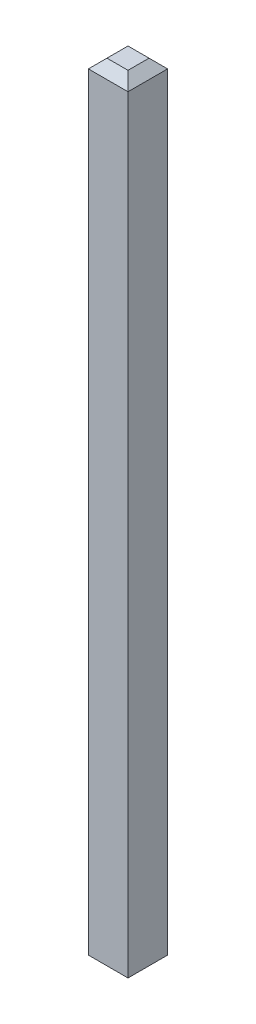
ISO-10303-21;
HEADER;
FILE_DESCRIPTION(('STEP AP214'),'2;1');
FILE_NAME('part.step','',(''),(''),'','','');
FILE_SCHEMA(('AUTOMOTIVE_DESIGN { 1 0 10303 214 1 1 1 1 }'));
ENDSEC;
DATA;
#1=APPLICATION_CONTEXT('core data for automotive mechanical design processes');
#2=APPLICATION_PROTOCOL_DEFINITION('international standard','automotive_design',2000,#1);
#3=PRODUCT_CONTEXT('',#1,'mechanical');
#4=PRODUCT('Part','Part','',(#3));
#5=PRODUCT_RELATED_PRODUCT_CATEGORY('part','',(#4));
#6=PRODUCT_DEFINITION_FORMATION('','',#4);
#7=PRODUCT_DEFINITION_CONTEXT('part definition',#1,'design');
#8=PRODUCT_DEFINITION('design','',#6,#7);
#9=PRODUCT_DEFINITION_SHAPE('','',#8);
#10=(LENGTH_UNIT() NAMED_UNIT(*) SI_UNIT(.MILLI.,.METRE.));
#11=(NAMED_UNIT(*) PLANE_ANGLE_UNIT() SI_UNIT($,.RADIAN.));
#12=(NAMED_UNIT(*) SI_UNIT($,.STERADIAN.) SOLID_ANGLE_UNIT());
#13=UNCERTAINTY_MEASURE_WITH_UNIT(LENGTH_MEASURE(1.E-05),#10,'distance_accuracy_value','');
#14=(GEOMETRIC_REPRESENTATION_CONTEXT(3) GLOBAL_UNCERTAINTY_ASSIGNED_CONTEXT((#13)) GLOBAL_UNIT_ASSIGNED_CONTEXT((#10,
#11,#12)) REPRESENTATION_CONTEXT('',''));
#15=CARTESIAN_POINT('',(0.,0.,0.));
#16=DIRECTION('',(0.,0.,1.));
#17=DIRECTION('',(1.,0.,0.));
#18=AXIS2_PLACEMENT_3D('',#15,#16,#17);
#19=CARTESIAN_POINT('',(1.11,-1.925,0.245));
#20=DIRECTION('',(0.,-0.707106781186547,0.707106781186548));
#21=DIRECTION('',(0.,-0.707106781186548,-0.707106781186547));
#22=AXIS2_PLACEMENT_3D('',#19,#20,#21);
#23=PLANE('',#22);
#24=DIRECTION('',(1.,0.,0.));
#25=VECTOR('',#24,1.);
#26=CARTESIAN_POINT('',(0.95,-1.85,0.32));
#27=LINE('',#26,#25);
#28=CARTESIAN_POINT('',(0.95,-1.85,0.32));
#29=VERTEX_POINT('',#28);
#30=CARTESIAN_POINT('',(1.59,-1.85,0.32));
#31=VERTEX_POINT('',#30);
#32=EDGE_CURVE('E96',#29,#31,#27,.T.);
#33=ORIENTED_EDGE('',*,*,#32,.F.);
#34=DIRECTION('',(-0.577350269189625,0.577350269189626,0.577350269189626));
#35=VECTOR('',#34,1.);
#36=CARTESIAN_POINT('',(1.1,-2.,0.17));
#37=LINE('',#36,#35);
#38=CARTESIAN_POINT('',(1.1,-2.,0.17));
#39=VERTEX_POINT('',#38);
#40=EDGE_CURVE('E94',#39,#29,#37,.T.);
#41=ORIENTED_EDGE('',*,*,#40,.F.);
#42=DIRECTION('',(1.,0.,0.));
#43=VECTOR('',#42,1.);
#44=CARTESIAN_POINT('',(1.27,-2.,0.17));
#45=LINE('',#44,#43);
#46=CARTESIAN_POINT('',(1.44,-2.,0.17));
#47=VERTEX_POINT('',#46);
#48=EDGE_CURVE('E20',#39,#47,#45,.T.);
#49=ORIENTED_EDGE('',*,*,#48,.T.);
#50=DIRECTION('',(-0.577350269189626,-0.577350269189626,-0.577350269189626));
#51=VECTOR('',#50,1.);
#52=CARTESIAN_POINT('',(1.59,-1.85,0.32));
#53=LINE('',#52,#51);
#54=EDGE_CURVE('E112',#31,#47,#53,.T.);
#55=ORIENTED_EDGE('',*,*,#54,.F.);
#56=EDGE_LOOP('',(#33,#41,#49,#55));
#57=FACE_BOUND('',#56,.T.);
#58=ADVANCED_FACE('F17',(#57),#23,.T.);
#59=CARTESIAN_POINT('',(1.11,10.625,0.245));
#60=DIRECTION('',(0.,0.70710678118655,0.707106781186545));
#61=DIRECTION('',(0.,-0.707106781186545,0.70710678118655));
#62=AXIS2_PLACEMENT_3D('',#59,#60,#61);
#63=PLANE('',#62);
#64=DIRECTION('',(1.,0.,0.));
#65=VECTOR('',#64,1.);
#66=CARTESIAN_POINT('',(0.95,10.55,0.32));
#67=LINE('',#66,#65);
#68=CARTESIAN_POINT('',(1.59,10.55,0.32));
#69=VERTEX_POINT('',#68);
#70=CARTESIAN_POINT('',(0.95,10.55,0.32));
#71=VERTEX_POINT('',#70);
#72=EDGE_CURVE('E121',#69,#71,#67,.F.);
#73=ORIENTED_EDGE('',*,*,#72,.F.);
#74=DIRECTION('',(0.577350269189627,-0.577350269189623,0.577350269189627));
#75=VECTOR('',#74,1.);
#76=CARTESIAN_POINT('',(1.44,10.7,0.17));
#77=LINE('',#76,#75);
#78=CARTESIAN_POINT('',(1.44,10.7,0.17));
#79=VERTEX_POINT('',#78);
#80=EDGE_CURVE('E118',#79,#69,#77,.T.);
#81=ORIENTED_EDGE('',*,*,#80,.F.);
#82=DIRECTION('',(1.,0.,0.));
#83=VECTOR('',#82,1.);
#84=CARTESIAN_POINT('',(1.27,10.7,0.17));
#85=LINE('',#84,#83);
#86=CARTESIAN_POINT('',(1.1,10.7,0.17));
#87=VERTEX_POINT('',#86);
#88=EDGE_CURVE('E79',#87,#79,#85,.T.);
#89=ORIENTED_EDGE('',*,*,#88,.F.);
#90=DIRECTION('',(0.577350269189627,0.577350269189623,-0.577350269189627));
#91=VECTOR('',#90,1.);
#92=CARTESIAN_POINT('',(0.949999999999999,10.55,0.32));
#93=LINE('',#92,#91);
#94=EDGE_CURVE('E109',#71,#87,#93,.T.);
#95=ORIENTED_EDGE('',*,*,#94,.F.);
#96=EDGE_LOOP('',(#73,#81,#89,#95));
#97=FACE_BOUND('',#96,.T.);
#98=ADVANCED_FACE('F283',(#97),#63,.T.);
#99=CARTESIAN_POINT('',(1.27,-2.,0.));
#100=DIRECTION('',(0.,1.,0.));
#101=DIRECTION('',(0.,0.,1.));
#102=AXIS2_PLACEMENT_3D('',#99,#100,#101);
#103=PLANE('',#102);
#104=DIRECTION('',(1.,0.,0.));
#105=VECTOR('',#104,1.);
#106=CARTESIAN_POINT('',(1.43,-2.,-0.17));
#107=LINE('',#106,#105);
#108=CARTESIAN_POINT('',(1.44,-2.,-0.17));
#109=VERTEX_POINT('',#108);
#110=CARTESIAN_POINT('',(1.1,-2.,-0.17));
#111=VERTEX_POINT('',#110);
#112=EDGE_CURVE('E124',#109,#111,#107,.F.);
#113=ORIENTED_EDGE('',*,*,#112,.F.);
#114=DIRECTION('',(0.,0.,1.));
#115=VECTOR('',#114,1.);
#116=CARTESIAN_POINT('',(1.44,-2.,0.16));
#117=LINE('',#116,#115);
#118=EDGE_CURVE('E90',#47,#109,#117,.F.);
#119=ORIENTED_EDGE('',*,*,#118,.F.);
#120=ORIENTED_EDGE('',*,*,#48,.F.);
#121=DIRECTION('',(0.,0.,1.));
#122=VECTOR('',#121,1.);
#123=CARTESIAN_POINT('',(1.1,-2.,-0.16));
#124=LINE('',#123,#122);
#125=EDGE_CURVE('E87',#111,#39,#124,.T.);
#126=ORIENTED_EDGE('',*,*,#125,.F.);
#127=EDGE_LOOP('',(#113,#119,#120,#126));
#128=FACE_BOUND('',#127,.T.);
#129=ADVANCED_FACE('F85',(#128),#103,.F.);
#130=CARTESIAN_POINT('',(1.025,-1.925,-0.16));
#131=DIRECTION('',(-0.707106781186548,-0.707106781186547,0.));
#132=DIRECTION('',(0.707106781186547,-0.707106781186548,0.));
#133=AXIS2_PLACEMENT_3D('',#130,#131,#132);
#134=PLANE('',#133);
#135=DIRECTION('',(0.,0.,1.));
#136=VECTOR('',#135,1.);
#137=CARTESIAN_POINT('',(0.95,-1.85,-0.32));
#138=LINE('',#137,#136);
#139=CARTESIAN_POINT('',(0.95,-1.85,-0.32));
#140=VERTEX_POINT('',#139);
#141=EDGE_CURVE('E130',#140,#29,#138,.T.);
#142=ORIENTED_EDGE('',*,*,#141,.F.);
#143=DIRECTION('',(-0.577350269189626,0.577350269189626,-0.577350269189625));
#144=VECTOR('',#143,1.);
#145=CARTESIAN_POINT('',(1.1,-2.,-0.17));
#146=LINE('',#145,#144);
#147=EDGE_CURVE('E102',#111,#140,#146,.T.);
#148=ORIENTED_EDGE('',*,*,#147,.F.);
#149=ORIENTED_EDGE('',*,*,#125,.T.);
#150=ORIENTED_EDGE('',*,*,#40,.T.);
#151=EDGE_LOOP('',(#142,#148,#149,#150));
#152=FACE_BOUND('',#151,.T.);
#153=ADVANCED_FACE('F100',(#152),#134,.T.);
#154=CARTESIAN_POINT('',(1.27,10.7,0.));
#155=DIRECTION('',(0.,1.,0.));
#156=DIRECTION('',(0.,0.,1.));
#157=AXIS2_PLACEMENT_3D('',#154,#155,#156);
#158=PLANE('',#157);
#159=DIRECTION('',(1.,0.,0.));
#160=VECTOR('',#159,1.);
#161=CARTESIAN_POINT('',(1.43,10.7,-0.170000000000001));
#162=LINE('',#161,#160);
#163=CARTESIAN_POINT('',(1.1,10.7,-0.17));
#164=VERTEX_POINT('',#163);
#165=CARTESIAN_POINT('',(1.44,10.7,-0.17));
#166=VERTEX_POINT('',#165);
#167=EDGE_CURVE('E139',#164,#166,#162,.T.);
#168=ORIENTED_EDGE('',*,*,#167,.F.);
#169=DIRECTION('',(0.,0.,1.));
#170=VECTOR('',#169,1.);
#171=CARTESIAN_POINT('',(1.1,10.7,-0.16));
#172=LINE('',#171,#170);
#173=EDGE_CURVE('E106',#87,#164,#172,.F.);
#174=ORIENTED_EDGE('',*,*,#173,.F.);
#175=ORIENTED_EDGE('',*,*,#88,.T.);
#176=DIRECTION('',(0.,0.,1.));
#177=VECTOR('',#176,1.);
#178=CARTESIAN_POINT('',(1.44,10.7,0.16));
#179=LINE('',#178,#177);
#180=EDGE_CURVE('E115',#166,#79,#179,.T.);
#181=ORIENTED_EDGE('',*,*,#180,.F.);
#182=EDGE_LOOP('',(#168,#174,#175,#181));
#183=FACE_BOUND('',#182,.T.);
#184=ADVANCED_FACE('F259',(#183),#158,.T.);
#185=CARTESIAN_POINT('',(1.025,10.625,-0.16));
#186=DIRECTION('',(-0.707106781186545,0.70710678118655,0.));
#187=DIRECTION('',(-0.70710678118655,-0.707106781186545,0.));
#188=AXIS2_PLACEMENT_3D('',#185,#186,#187);
#189=PLANE('',#188);
#190=DIRECTION('',(0.,0.,1.));
#191=VECTOR('',#190,1.);
#192=CARTESIAN_POINT('',(0.95,10.55,-0.32));
#193=LINE('',#192,#191);
#194=CARTESIAN_POINT('',(0.95,10.55,-0.32));
#195=VERTEX_POINT('',#194);
#196=EDGE_CURVE('E136',#71,#195,#193,.F.);
#197=ORIENTED_EDGE('',*,*,#196,.F.);
#198=ORIENTED_EDGE('',*,*,#94,.T.);
#199=ORIENTED_EDGE('',*,*,#173,.T.);
#200=DIRECTION('',(0.577350269189627,0.577350269189623,0.577350269189627));
#201=VECTOR('',#200,1.);
#202=CARTESIAN_POINT('',(0.95,10.55,-0.320000000000001));
#203=LINE('',#202,#201);
#204=EDGE_CURVE('E144',#195,#164,#203,.T.);
#205=ORIENTED_EDGE('',*,*,#204,.F.);
#206=EDGE_LOOP('',(#197,#198,#199,#205));
#207=FACE_BOUND('',#206,.T.);
#208=ADVANCED_FACE('F251',(#207),#189,.T.);
#209=CARTESIAN_POINT('',(1.515,-1.925,0.16));
#210=DIRECTION('',(0.707106781186548,-0.707106781186548,0.));
#211=DIRECTION('',(0.707106781186548,0.707106781186548,0.));
#212=AXIS2_PLACEMENT_3D('',#209,#210,#211);
#213=PLANE('',#212);
#214=ORIENTED_EDGE('',*,*,#118,.T.);
#215=DIRECTION('',(-0.577350269189627,-0.577350269189626,0.577350269189625));
#216=VECTOR('',#215,1.);
#217=CARTESIAN_POINT('',(1.59,-1.85,-0.32));
#218=LINE('',#217,#216);
#219=CARTESIAN_POINT('',(1.59,-1.85,-0.32));
#220=VERTEX_POINT('',#219);
#221=EDGE_CURVE('E127',#220,#109,#218,.T.);
#222=ORIENTED_EDGE('',*,*,#221,.F.);
#223=DIRECTION('',(0.,0.,-1.));
#224=VECTOR('',#223,1.);
#225=CARTESIAN_POINT('',(1.59,-1.85,0.32));
#226=LINE('',#225,#224);
#227=EDGE_CURVE('E147',#31,#220,#226,.T.);
#228=ORIENTED_EDGE('',*,*,#227,.F.);
#229=ORIENTED_EDGE('',*,*,#54,.T.);
#230=EDGE_LOOP('',(#214,#222,#228,#229));
#231=FACE_BOUND('',#230,.T.);
#232=ADVANCED_FACE('F173',(#231),#213,.T.);
#233=CARTESIAN_POINT('',(1.515,10.625,0.16));
#234=DIRECTION('',(0.707106781186545,0.70710678118655,0.));
#235=DIRECTION('',(-0.70710678118655,0.707106781186545,0.));
#236=AXIS2_PLACEMENT_3D('',#233,#234,#235);
#237=PLANE('',#236);
#238=ORIENTED_EDGE('',*,*,#180,.T.);
#239=ORIENTED_EDGE('',*,*,#80,.T.);
#240=DIRECTION('',(0.,0.,-1.));
#241=VECTOR('',#240,1.);
#242=CARTESIAN_POINT('',(1.59,10.55,0.32));
#243=LINE('',#242,#241);
#244=CARTESIAN_POINT('',(1.59,10.55,-0.32));
#245=VERTEX_POINT('',#244);
#246=EDGE_CURVE('E35',#245,#69,#243,.F.);
#247=ORIENTED_EDGE('',*,*,#246,.F.);
#248=DIRECTION('',(0.577350269189627,-0.577350269189623,-0.577350269189627));
#249=VECTOR('',#248,1.);
#250=CARTESIAN_POINT('',(1.44,10.7,-0.170000000000001));
#251=LINE('',#250,#249);
#252=EDGE_CURVE('E142',#166,#245,#251,.T.);
#253=ORIENTED_EDGE('',*,*,#252,.F.);
#254=EDGE_LOOP('',(#238,#239,#247,#253));
#255=FACE_BOUND('',#254,.T.);
#256=ADVANCED_FACE('F190',(#255),#237,.T.);
#257=CARTESIAN_POINT('',(0.95,-2.,0.32));
#258=DIRECTION('',(0.,0.,1.));
#259=DIRECTION('',(1.,0.,0.));
#260=AXIS2_PLACEMENT_3D('',#257,#258,#259);
#261=PLANE('',#260);
#262=ORIENTED_EDGE('',*,*,#72,.T.);
#263=DIRECTION('',(0.,1.,0.));
#264=VECTOR('',#263,1.);
#265=CARTESIAN_POINT('',(0.95,-2.,0.32));
#266=LINE('',#265,#264);
#267=EDGE_CURVE('E133',#29,#71,#266,.T.);
#268=ORIENTED_EDGE('',*,*,#267,.F.);
#269=ORIENTED_EDGE('',*,*,#32,.T.);
#270=DIRECTION('',(0.,1.,0.));
#271=VECTOR('',#270,1.);
#272=CARTESIAN_POINT('',(1.59,-2.,0.32));
#273=LINE('',#272,#271);
#274=EDGE_CURVE('E151',#69,#31,#273,.F.);
#275=ORIENTED_EDGE('',*,*,#274,.F.);
#276=EDGE_LOOP('',(#262,#268,#269,#275));
#277=FACE_BOUND('',#276,.T.);
#278=ADVANCED_FACE('F176',(#277),#261,.T.);
#279=CARTESIAN_POINT('',(1.43,-1.925,-0.245));
#280=DIRECTION('',(0.,-0.707106781186547,-0.707106781186548));
#281=DIRECTION('',(0.,0.707106781186548,-0.707106781186547));
#282=AXIS2_PLACEMENT_3D('',#279,#280,#281);
#283=PLANE('',#282);
#284=DIRECTION('',(-1.,0.,0.));
#285=VECTOR('',#284,1.);
#286=CARTESIAN_POINT('',(1.59,-1.85,-0.32));
#287=LINE('',#286,#285);
#288=EDGE_CURVE('E154',#220,#140,#287,.T.);
#289=ORIENTED_EDGE('',*,*,#288,.F.);
#290=ORIENTED_EDGE('',*,*,#221,.T.);
#291=ORIENTED_EDGE('',*,*,#112,.T.);
#292=ORIENTED_EDGE('',*,*,#147,.T.);
#293=EDGE_LOOP('',(#289,#290,#291,#292));
#294=FACE_BOUND('',#293,.T.);
#295=ADVANCED_FACE('F181',(#294),#283,.T.);
#296=CARTESIAN_POINT('',(0.95,-2.,-0.32));
#297=DIRECTION('',(-1.,0.,0.));
#298=DIRECTION('',(0.,0.,1.));
#299=AXIS2_PLACEMENT_3D('',#296,#297,#298);
#300=PLANE('',#299);
#301=ORIENTED_EDGE('',*,*,#196,.T.);
#302=DIRECTION('',(0.,1.,0.));
#303=VECTOR('',#302,1.);
#304=CARTESIAN_POINT('',(0.95,-2.,-0.32));
#305=LINE('',#304,#303);
#306=EDGE_CURVE('E157',#140,#195,#305,.T.);
#307=ORIENTED_EDGE('',*,*,#306,.F.);
#308=ORIENTED_EDGE('',*,*,#141,.T.);
#309=ORIENTED_EDGE('',*,*,#267,.T.);
#310=EDGE_LOOP('',(#301,#307,#308,#309));
#311=FACE_BOUND('',#310,.T.);
#312=ADVANCED_FACE('F179',(#311),#300,.T.);
#313=CARTESIAN_POINT('',(1.43,10.625,-0.245));
#314=DIRECTION('',(0.,0.70710678118655,-0.707106781186545));
#315=DIRECTION('',(0.,0.707106781186545,0.70710678118655));
#316=AXIS2_PLACEMENT_3D('',#313,#314,#315);
#317=PLANE('',#316);
#318=DIRECTION('',(-1.,0.,0.));
#319=VECTOR('',#318,1.);
#320=CARTESIAN_POINT('',(1.59,10.55,-0.32));
#321=LINE('',#320,#319);
#322=EDGE_CURVE('E26',#195,#245,#321,.F.);
#323=ORIENTED_EDGE('',*,*,#322,.F.);
#324=ORIENTED_EDGE('',*,*,#204,.T.);
#325=ORIENTED_EDGE('',*,*,#167,.T.);
#326=ORIENTED_EDGE('',*,*,#252,.T.);
#327=EDGE_LOOP('',(#323,#324,#325,#326));
#328=FACE_BOUND('',#327,.T.);
#329=ADVANCED_FACE('F167',(#328),#317,.T.);
#330=CARTESIAN_POINT('',(1.59,-2.,0.32));
#331=DIRECTION('',(1.,0.,0.));
#332=DIRECTION('',(0.,0.,-1.));
#333=AXIS2_PLACEMENT_3D('',#330,#331,#332);
#334=PLANE('',#333);
#335=ORIENTED_EDGE('',*,*,#246,.T.);
#336=ORIENTED_EDGE('',*,*,#274,.T.);
#337=ORIENTED_EDGE('',*,*,#227,.T.);
#338=DIRECTION('',(0.,1.,0.));
#339=VECTOR('',#338,1.);
#340=CARTESIAN_POINT('',(1.59,-2.,-0.32));
#341=LINE('',#340,#339);
#342=EDGE_CURVE('E11',#245,#220,#341,.F.);
#343=ORIENTED_EDGE('',*,*,#342,.F.);
#344=EDGE_LOOP('',(#335,#336,#337,#343));
#345=FACE_BOUND('',#344,.T.);
#346=ADVANCED_FACE('F169',(#345),#334,.T.);
#347=CARTESIAN_POINT('',(1.59,-2.,-0.32));
#348=DIRECTION('',(0.,0.,-1.));
#349=DIRECTION('',(-1.,0.,0.));
#350=AXIS2_PLACEMENT_3D('',#347,#348,#349);
#351=PLANE('',#350);
#352=ORIENTED_EDGE('',*,*,#322,.T.);
#353=ORIENTED_EDGE('',*,*,#342,.T.);
#354=ORIENTED_EDGE('',*,*,#288,.T.);
#355=ORIENTED_EDGE('',*,*,#306,.T.);
#356=EDGE_LOOP('',(#352,#353,#354,#355));
#357=FACE_BOUND('',#356,.T.);
#358=ADVANCED_FACE('F163',(#357),#351,.T.);
#359=CLOSED_SHELL('',(#58,#98,#129,#153,#184,#208,#232,#256,#278,#295,#312,#329,#346,#358));
#360=MANIFOLD_SOLID_BREP('B1',#359);
#361=ADVANCED_BREP_SHAPE_REPRESENTATION('',(#18,#360),#14);
#362=SHAPE_DEFINITION_REPRESENTATION(#9,#361);
ENDSEC;
END-ISO-10303-21;
